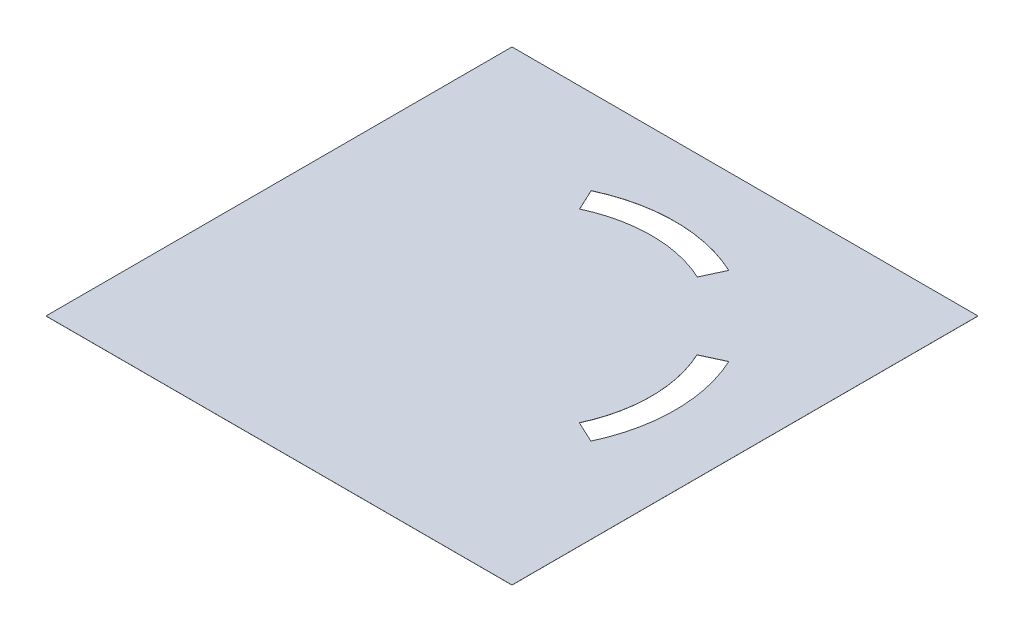
ISO-10303-21;
HEADER;
FILE_DESCRIPTION(('STEP AP214'),'2;1');
FILE_NAME('part.step','',(''),(''),'','','');
FILE_SCHEMA(('AUTOMOTIVE_DESIGN { 1 0 10303 214 1 1 1 1 }'));
ENDSEC;
DATA;
#1=APPLICATION_CONTEXT('core data for automotive mechanical design processes');
#2=APPLICATION_PROTOCOL_DEFINITION('international standard','automotive_design',2000,#1);
#3=PRODUCT_CONTEXT('',#1,'mechanical');
#4=PRODUCT('Part','Part','',(#3));
#5=PRODUCT_RELATED_PRODUCT_CATEGORY('part','',(#4));
#6=PRODUCT_DEFINITION_FORMATION('','',#4);
#7=PRODUCT_DEFINITION_CONTEXT('part definition',#1,'design');
#8=PRODUCT_DEFINITION('design','',#6,#7);
#9=PRODUCT_DEFINITION_SHAPE('','',#8);
#10=(LENGTH_UNIT() NAMED_UNIT(*) SI_UNIT(.MILLI.,.METRE.));
#11=(NAMED_UNIT(*) PLANE_ANGLE_UNIT() SI_UNIT($,.RADIAN.));
#12=(NAMED_UNIT(*) SI_UNIT($,.STERADIAN.) SOLID_ANGLE_UNIT());
#13=UNCERTAINTY_MEASURE_WITH_UNIT(LENGTH_MEASURE(1.E-05),#10,'distance_accuracy_value','');
#14=(GEOMETRIC_REPRESENTATION_CONTEXT(3) GLOBAL_UNCERTAINTY_ASSIGNED_CONTEXT((#13)) GLOBAL_UNIT_ASSIGNED_CONTEXT((#10,
#11,#12)) REPRESENTATION_CONTEXT('',''));
#15=CARTESIAN_POINT('',(0.,0.,0.));
#16=DIRECTION('',(0.,0.,1.));
#17=DIRECTION('',(1.,0.,0.));
#18=AXIS2_PLACEMENT_3D('',#15,#16,#17);
#19=CARTESIAN_POINT('',(13.2576267191403,0.0175,-13.2574791714362));
#20=DIRECTION('',(0.,-1.,0.));
#21=DIRECTION('',(0.,0.,-1.));
#22=AXIS2_PLACEMENT_3D('',#19,#20,#21);
#23=PLANE('',#22);
#24=CARTESIAN_POINT('',(53.4194512426701,0.0175,-53.4314063103269));
#25=DIRECTION('',(0.,-1.,0.));
#26=DIRECTION('',(0.,0.,-1.));
#27=AXIS2_PLACEMENT_3D('',#24,#25,#26);
#28=CIRCLE('',#27,24.0076771388907);
#29=CARTESIAN_POINT('',(43.2733684618004,0.0175,-75.1897510499654));
#30=VERTEX_POINT('',#29);
#31=CARTESIAN_POINT('',(63.56553402354,0.0175,-75.1897510499654));
#32=VERTEX_POINT('',#31);
#33=EDGE_CURVE('E160',#30,#32,#28,.T.);
#34=ORIENTED_EDGE('',*,*,#33,.F.);
#35=DIRECTION('',(0.422618261740692,0.,0.906307787036653));
#36=VECTOR('',#35,1.);
#37=CARTESIAN_POINT('',(43.2733684618004,0.0175,-75.1897510499654));
#38=LINE('',#37,#36);
#39=CARTESIAN_POINT('',(41.5290773816095,0.0175,-78.930395342818));
#40=VERTEX_POINT('',#39);
#41=EDGE_CURVE('E168',#40,#30,#38,.T.);
#42=ORIENTED_EDGE('',*,*,#41,.F.);
#43=CARTESIAN_POINT('',(53.3607026830961,0.0175,-53.6709418962078));
#44=DIRECTION('',(0.,1.,0.));
#45=DIRECTION('',(0.,0.,-1.));
#46=AXIS2_PLACEMENT_3D('',#43,#44,#45);
#47=CIRCLE('',#46,27.8931415530099);
#48=CARTESIAN_POINT('',(65.2886760566713,0.0175,-78.8850410650364));
#49=VERTEX_POINT('',#48);
#50=EDGE_CURVE('E165',#49,#40,#47,.T.);
#51=ORIENTED_EDGE('',*,*,#50,.F.);
#52=DIRECTION('',(0.422618261740697,0.,-0.906307787036651));
#53=VECTOR('',#52,1.);
#54=CARTESIAN_POINT('',(63.56553402354,0.0175,-75.1897510499654));
#55=LINE('',#54,#53);
#56=EDGE_CURVE('E162',#32,#49,#55,.T.);
#57=ORIENTED_EDGE('',*,*,#56,.F.);
#58=EDGE_LOOP('',(#34,#42,#51,#57));
#59=FACE_BOUND('',#58,.T.);
#60=DIRECTION('',(1.,0.,0.));
#61=VECTOR('',#60,1.);
#62=CARTESIAN_POINT('',(13.2576267191403,0.0175,-13.2574791714362));
#63=LINE('',#62,#61);
#64=CARTESIAN_POINT('',(13.2576267191403,0.0175,-13.2574791714362));
#65=VERTEX_POINT('',#64);
#66=CARTESIAN_POINT('',(93.5601267191403,0.0175,-13.2574791714362));
#67=VERTEX_POINT('',#66);
#68=EDGE_CURVE('E191',#65,#67,#63,.T.);
#69=ORIENTED_EDGE('',*,*,#68,.T.);
#70=DIRECTION('',(0.,0.,-1.));
#71=VECTOR('',#70,1.);
#72=CARTESIAN_POINT('',(93.5601267191403,0.0175,-93.5599791714362));
#73=LINE('',#72,#71);
#74=CARTESIAN_POINT('',(93.5601267191403,0.0175,-93.5599791714362));
#75=VERTEX_POINT('',#74);
#76=EDGE_CURVE('E194',#67,#75,#73,.T.);
#77=ORIENTED_EDGE('',*,*,#76,.T.);
#78=DIRECTION('',(-1.,0.,0.));
#79=VECTOR('',#78,1.);
#80=CARTESIAN_POINT('',(13.2576267191403,0.0175,-93.5599791714362));
#81=LINE('',#80,#79);
#82=CARTESIAN_POINT('',(13.2576267191403,0.0175,-93.5599791714362));
#83=VERTEX_POINT('',#82);
#84=EDGE_CURVE('E197',#75,#83,#81,.T.);
#85=ORIENTED_EDGE('',*,*,#84,.T.);
#86=DIRECTION('',(0.,0.,1.));
#87=VECTOR('',#86,1.);
#88=CARTESIAN_POINT('',(13.2576267191403,0.0175,-13.2574791714362));
#89=LINE('',#88,#87);
#90=EDGE_CURVE('E199',#83,#65,#89,.T.);
#91=ORIENTED_EDGE('',*,*,#90,.T.);
#92=EDGE_LOOP('',(#69,#77,#85,#91));
#93=FACE_BOUND('',#92,.T.);
#94=CARTESIAN_POINT('',(53.4088767191403,0.0175,-53.4087291714362));
#95=DIRECTION('',(0.,-1.,0.));
#96=DIRECTION('',(0.,0.,-1.));
#97=AXIS2_PLACEMENT_3D('',#94,#95,#96);
#98=CIRCLE('',#97,23.9850000000001);
#99=CARTESIAN_POINT('',(75.1466689912143,0.0175,-63.5452281792869));
#100=VERTEX_POINT('',#99);
#101=CARTESIAN_POINT('',(75.1466689912144,0.0175,-43.2722301635855));
#102=VERTEX_POINT('',#101);
#103=EDGE_CURVE('E124',#100,#102,#98,.T.);
#104=ORIENTED_EDGE('',*,*,#103,.F.);
#105=DIRECTION('',(-0.906307787036649,0.,0.422618261740701));
#106=VECTOR('',#105,1.);
#107=CARTESIAN_POINT('',(75.1466689912143,0.0175,-63.5452281792869));
#108=LINE('',#107,#106);
#109=CARTESIAN_POINT('',(78.8851886127405,0.0175,-65.2885285089673));
#110=VERTEX_POINT('',#109);
#111=EDGE_CURVE('E146',#110,#100,#108,.T.);
#112=ORIENTED_EDGE('',*,*,#111,.F.);
#113=CARTESIAN_POINT('',(53.4088767191403,0.0175,-53.4087291714361));
#114=DIRECTION('',(0.,1.,0.));
#115=DIRECTION('',(0.,0.,-1.));
#116=AXIS2_PLACEMENT_3D('',#113,#114,#115);
#117=CIRCLE('',#116,28.11);
#118=CARTESIAN_POINT('',(78.8851886127405,0.0175,-41.5289298339051));
#119=VERTEX_POINT('',#118);
#120=EDGE_CURVE('E144',#119,#110,#117,.T.);
#121=ORIENTED_EDGE('',*,*,#120,.F.);
#122=DIRECTION('',(0.906307787036649,0.,0.422618261740701));
#123=VECTOR('',#122,1.);
#124=CARTESIAN_POINT('',(75.1466689912144,0.0175,-43.2722301635855));
#125=LINE('',#124,#123);
#126=EDGE_CURVE('E132',#102,#119,#125,.T.);
#127=ORIENTED_EDGE('',*,*,#126,.F.);
#128=EDGE_LOOP('',(#104,#112,#121,#127));
#129=FACE_BOUND('',#128,.T.);
#130=ADVANCED_FACE('F35',(#59,#93,#129),#23,.F.);
#131=CARTESIAN_POINT('',(13.2576267191403,0.0025,-13.2574791714362));
#132=DIRECTION('',(0.,-1.,0.));
#133=DIRECTION('',(0.,0.,-1.));
#134=AXIS2_PLACEMENT_3D('',#131,#132,#133);
#135=PLANE('',#134);
#136=DIRECTION('',(1.,0.,0.));
#137=VECTOR('',#136,1.);
#138=CARTESIAN_POINT('',(13.2576267191403,0.0025,-13.2574791714362));
#139=LINE('',#138,#137);
#140=CARTESIAN_POINT('',(13.2576267191403,0.0025,-13.2574791714362));
#141=VERTEX_POINT('',#140);
#142=CARTESIAN_POINT('',(93.5601267191403,0.0025,-13.2574791714362));
#143=VERTEX_POINT('',#142);
#144=EDGE_CURVE('E190',#141,#143,#139,.T.);
#145=ORIENTED_EDGE('',*,*,#144,.F.);
#146=DIRECTION('',(0.,0.,1.));
#147=VECTOR('',#146,1.);
#148=CARTESIAN_POINT('',(13.2576267191403,0.0025,-13.2574791714362));
#149=LINE('',#148,#147);
#150=CARTESIAN_POINT('',(13.2576267191403,0.0025,-93.5599791714362));
#151=VERTEX_POINT('',#150);
#152=EDGE_CURVE('E195',#151,#141,#149,.T.);
#153=ORIENTED_EDGE('',*,*,#152,.F.);
#154=DIRECTION('',(-1.,0.,0.));
#155=VECTOR('',#154,1.);
#156=CARTESIAN_POINT('',(13.2576267191403,0.0025,-93.5599791714362));
#157=LINE('',#156,#155);
#158=CARTESIAN_POINT('',(93.5601267191403,0.0025,-93.5599791714362));
#159=VERTEX_POINT('',#158);
#160=EDGE_CURVE('E206',#159,#151,#157,.T.);
#161=ORIENTED_EDGE('',*,*,#160,.F.);
#162=DIRECTION('',(0.,0.,-1.));
#163=VECTOR('',#162,1.);
#164=CARTESIAN_POINT('',(93.5601267191403,0.0025,-93.5599791714362));
#165=LINE('',#164,#163);
#166=EDGE_CURVE('E204',#143,#159,#165,.T.);
#167=ORIENTED_EDGE('',*,*,#166,.F.);
#168=EDGE_LOOP('',(#145,#153,#161,#167));
#169=FACE_BOUND('',#168,.T.);
#170=DIRECTION('',(0.422618261740692,0.,0.906307787036653));
#171=VECTOR('',#170,1.);
#172=CARTESIAN_POINT('',(43.2733684618004,0.0025,-75.1897510499654));
#173=LINE('',#172,#171);
#174=CARTESIAN_POINT('',(41.5290773816095,0.0025,-78.930395342818));
#175=VERTEX_POINT('',#174);
#176=CARTESIAN_POINT('',(43.2733684618004,0.0025,-75.1897510499655));
#177=VERTEX_POINT('',#176);
#178=EDGE_CURVE('E163',#175,#177,#173,.T.);
#179=ORIENTED_EDGE('',*,*,#178,.T.);
#180=CARTESIAN_POINT('',(53.4194512426701,0.0025,-53.4314063103269));
#181=DIRECTION('',(0.,-1.,0.));
#182=DIRECTION('',(0.,0.,-1.));
#183=AXIS2_PLACEMENT_3D('',#180,#181,#182);
#184=CIRCLE('',#183,24.0076771388907);
#185=CARTESIAN_POINT('',(63.56553402354,0.0025,-75.1897510499654));
#186=VERTEX_POINT('',#185);
#187=EDGE_CURVE('E140',#177,#186,#184,.T.);
#188=ORIENTED_EDGE('',*,*,#187,.T.);
#189=DIRECTION('',(0.422618261740697,0.,-0.906307787036651));
#190=VECTOR('',#189,1.);
#191=CARTESIAN_POINT('',(63.56553402354,0.0025,-75.1897510499654));
#192=LINE('',#191,#190);
#193=CARTESIAN_POINT('',(65.2886760566713,0.0025,-78.8850410650364));
#194=VERTEX_POINT('',#193);
#195=EDGE_CURVE('E173',#186,#194,#192,.T.);
#196=ORIENTED_EDGE('',*,*,#195,.T.);
#197=CARTESIAN_POINT('',(53.3607026830961,0.0025,-53.6709418962078));
#198=DIRECTION('',(0.,1.,0.));
#199=DIRECTION('',(0.,0.,-1.));
#200=AXIS2_PLACEMENT_3D('',#197,#198,#199);
#201=CIRCLE('',#200,27.8931415530099);
#202=EDGE_CURVE('E176',#194,#175,#201,.T.);
#203=ORIENTED_EDGE('',*,*,#202,.T.);
#204=EDGE_LOOP('',(#179,#188,#196,#203));
#205=FACE_BOUND('',#204,.T.);
#206=DIRECTION('',(-0.906307787036649,0.,0.422618261740701));
#207=VECTOR('',#206,1.);
#208=CARTESIAN_POINT('',(75.1466689912143,0.0025,-63.5452281792869));
#209=LINE('',#208,#207);
#210=CARTESIAN_POINT('',(78.8851886127405,0.0025,-65.2885285089673));
#211=VERTEX_POINT('',#210);
#212=CARTESIAN_POINT('',(75.1466689912143,0.0025,-63.5452281792869));
#213=VERTEX_POINT('',#212);
#214=EDGE_CURVE('E133',#211,#213,#209,.T.);
#215=ORIENTED_EDGE('',*,*,#214,.T.);
#216=CARTESIAN_POINT('',(53.4088767191403,0.0025,-53.4087291714362));
#217=DIRECTION('',(0.,-1.,0.));
#218=DIRECTION('',(0.,0.,-1.));
#219=AXIS2_PLACEMENT_3D('',#216,#217,#218);
#220=CIRCLE('',#219,23.9850000000001);
#221=CARTESIAN_POINT('',(75.1466689912144,0.0025,-43.2722301635855));
#222=VERTEX_POINT('',#221);
#223=EDGE_CURVE('E58',#213,#222,#220,.T.);
#224=ORIENTED_EDGE('',*,*,#223,.T.);
#225=DIRECTION('',(0.906307787036649,0.,0.422618261740701));
#226=VECTOR('',#225,1.);
#227=CARTESIAN_POINT('',(75.1466689912144,0.0025,-43.2722301635855));
#228=LINE('',#227,#226);
#229=CARTESIAN_POINT('',(78.8851886127405,0.0025,-41.5289298339051));
#230=VERTEX_POINT('',#229);
#231=EDGE_CURVE('E139',#222,#230,#228,.T.);
#232=ORIENTED_EDGE('',*,*,#231,.T.);
#233=CARTESIAN_POINT('',(53.4088767191403,0.0025,-53.4087291714361));
#234=DIRECTION('',(0.,1.,0.));
#235=DIRECTION('',(0.,0.,-1.));
#236=AXIS2_PLACEMENT_3D('',#233,#234,#235);
#237=CIRCLE('',#236,28.11);
#238=EDGE_CURVE('E152',#230,#211,#237,.T.);
#239=ORIENTED_EDGE('',*,*,#238,.T.);
#240=EDGE_LOOP('',(#215,#224,#232,#239));
#241=FACE_BOUND('',#240,.T.);
#242=ADVANCED_FACE('F224',(#169,#205,#241),#135,.T.);
#243=CARTESIAN_POINT('',(13.2576267191403,0.0175,-13.2574791714362));
#244=DIRECTION('',(0.,0.,-1.));
#245=DIRECTION('',(-1.,0.,0.));
#246=AXIS2_PLACEMENT_3D('',#243,#244,#245);
#247=PLANE('',#246);
#248=ORIENTED_EDGE('',*,*,#144,.T.);
#249=DIRECTION('',(0.,-1.,0.));
#250=VECTOR('',#249,1.);
#251=CARTESIAN_POINT('',(93.5601267191403,0.0175,-13.2574791714362));
#252=LINE('',#251,#250);
#253=EDGE_CURVE('E11',#67,#143,#252,.T.);
#254=ORIENTED_EDGE('',*,*,#253,.F.);
#255=ORIENTED_EDGE('',*,*,#68,.F.);
#256=DIRECTION('',(0.,-1.,0.));
#257=VECTOR('',#256,1.);
#258=CARTESIAN_POINT('',(13.2576267191403,0.0175,-13.2574791714362));
#259=LINE('',#258,#257);
#260=EDGE_CURVE('E201',#65,#141,#259,.T.);
#261=ORIENTED_EDGE('',*,*,#260,.T.);
#262=EDGE_LOOP('',(#248,#254,#255,#261));
#263=FACE_BOUND('',#262,.T.);
#264=ADVANCED_FACE('F37',(#263),#247,.F.);
#265=CARTESIAN_POINT('',(93.5601267191403,0.0175,-93.5599791714362));
#266=DIRECTION('',(-1.,0.,0.));
#267=DIRECTION('',(0.,0.,1.));
#268=AXIS2_PLACEMENT_3D('',#265,#266,#267);
#269=PLANE('',#268);
#270=ORIENTED_EDGE('',*,*,#166,.T.);
#271=DIRECTION('',(0.,-1.,0.));
#272=VECTOR('',#271,1.);
#273=CARTESIAN_POINT('',(93.5601267191403,0.0175,-93.5599791714362));
#274=LINE('',#273,#272);
#275=EDGE_CURVE('E43',#75,#159,#274,.T.);
#276=ORIENTED_EDGE('',*,*,#275,.F.);
#277=ORIENTED_EDGE('',*,*,#76,.F.);
#278=ORIENTED_EDGE('',*,*,#253,.T.);
#279=EDGE_LOOP('',(#270,#276,#277,#278));
#280=FACE_BOUND('',#279,.T.);
#281=ADVANCED_FACE('F234',(#280),#269,.F.);
#282=CARTESIAN_POINT('',(13.2576267191403,0.0175,-93.5599791714362));
#283=DIRECTION('',(0.,0.,1.));
#284=DIRECTION('',(1.,0.,0.));
#285=AXIS2_PLACEMENT_3D('',#282,#283,#284);
#286=PLANE('',#285);
#287=ORIENTED_EDGE('',*,*,#160,.T.);
#288=DIRECTION('',(0.,-1.,0.));
#289=VECTOR('',#288,1.);
#290=CARTESIAN_POINT('',(13.2576267191403,0.0175,-93.5599791714362));
#291=LINE('',#290,#289);
#292=EDGE_CURVE('E211',#83,#151,#291,.T.);
#293=ORIENTED_EDGE('',*,*,#292,.F.);
#294=ORIENTED_EDGE('',*,*,#84,.F.);
#295=ORIENTED_EDGE('',*,*,#275,.T.);
#296=EDGE_LOOP('',(#287,#293,#294,#295));
#297=FACE_BOUND('',#296,.T.);
#298=ADVANCED_FACE('F218',(#297),#286,.F.);
#299=CARTESIAN_POINT('',(13.2576267191403,0.0175,-13.2574791714362));
#300=DIRECTION('',(1.,0.,0.));
#301=DIRECTION('',(0.,0.,-1.));
#302=AXIS2_PLACEMENT_3D('',#299,#300,#301);
#303=PLANE('',#302);
#304=ORIENTED_EDGE('',*,*,#152,.T.);
#305=ORIENTED_EDGE('',*,*,#260,.F.);
#306=ORIENTED_EDGE('',*,*,#90,.F.);
#307=ORIENTED_EDGE('',*,*,#292,.T.);
#308=EDGE_LOOP('',(#304,#305,#306,#307));
#309=FACE_BOUND('',#308,.T.);
#310=ADVANCED_FACE('F228',(#309),#303,.F.);
#311=CARTESIAN_POINT('',(53.4194512426701,0.0175,-53.4314063103269));
#312=DIRECTION('',(0.,-1.,0.));
#313=DIRECTION('',(0.,0.,-1.));
#314=AXIS2_PLACEMENT_3D('',#311,#312,#313);
#315=CYLINDRICAL_SURFACE('',#314,24.0076771388907);
#316=ORIENTED_EDGE('',*,*,#187,.F.);
#317=DIRECTION('',(0.,-1.,0.));
#318=VECTOR('',#317,1.);
#319=CARTESIAN_POINT('',(43.2733684618004,0.0175,-75.1897510499654));
#320=LINE('',#319,#318);
#321=EDGE_CURVE('E170',#30,#177,#320,.T.);
#322=ORIENTED_EDGE('',*,*,#321,.F.);
#323=ORIENTED_EDGE('',*,*,#33,.T.);
#324=DIRECTION('',(0.,-1.,0.));
#325=VECTOR('',#324,1.);
#326=CARTESIAN_POINT('',(63.56553402354,0.0175,-75.1897510499654));
#327=LINE('',#326,#325);
#328=EDGE_CURVE('E187',#32,#186,#327,.T.);
#329=ORIENTED_EDGE('',*,*,#328,.T.);
#330=EDGE_LOOP('',(#316,#322,#323,#329));
#331=FACE_BOUND('',#330,.T.);
#332=ADVANCED_FACE('F250',(#331),#315,.T.);
#333=CARTESIAN_POINT('',(63.56553402354,0.0175,-75.1897510499654));
#334=DIRECTION('',(-0.906307787036651,0.,-0.422618261740697));
#335=DIRECTION('',(-0.422618261740697,0.,0.906307787036651));
#336=AXIS2_PLACEMENT_3D('',#333,#334,#335);
#337=PLANE('',#336);
#338=ORIENTED_EDGE('',*,*,#195,.F.);
#339=ORIENTED_EDGE('',*,*,#328,.F.);
#340=ORIENTED_EDGE('',*,*,#56,.T.);
#341=DIRECTION('',(0.,-1.,0.));
#342=VECTOR('',#341,1.);
#343=CARTESIAN_POINT('',(65.2886760566713,0.0175,-78.8850410650364));
#344=LINE('',#343,#342);
#345=EDGE_CURVE('E185',#49,#194,#344,.T.);
#346=ORIENTED_EDGE('',*,*,#345,.T.);
#347=EDGE_LOOP('',(#338,#339,#340,#346));
#348=FACE_BOUND('',#347,.T.);
#349=ADVANCED_FACE('F257',(#348),#337,.T.);
#350=CARTESIAN_POINT('',(53.3607026830961,0.0175,-53.6709418962078));
#351=DIRECTION('',(0.,-1.,0.));
#352=DIRECTION('',(0.,0.,-1.));
#353=AXIS2_PLACEMENT_3D('',#350,#351,#352);
#354=CYLINDRICAL_SURFACE('',#353,27.8931415530099);
#355=ORIENTED_EDGE('',*,*,#202,.F.);
#356=ORIENTED_EDGE('',*,*,#345,.F.);
#357=ORIENTED_EDGE('',*,*,#50,.T.);
#358=DIRECTION('',(0.,-1.,0.));
#359=VECTOR('',#358,1.);
#360=CARTESIAN_POINT('',(41.5290773816095,0.0175,-78.930395342818));
#361=LINE('',#360,#359);
#362=EDGE_CURVE('E183',#40,#175,#361,.T.);
#363=ORIENTED_EDGE('',*,*,#362,.T.);
#364=EDGE_LOOP('',(#355,#356,#357,#363));
#365=FACE_BOUND('',#364,.T.);
#366=ADVANCED_FACE('F262',(#365),#354,.F.);
#367=CARTESIAN_POINT('',(43.2733684618004,0.0175,-75.1897510499654));
#368=DIRECTION('',(0.906307787036653,0.,-0.422618261740692));
#369=DIRECTION('',(-0.422618261740692,0.,-0.906307787036653));
#370=AXIS2_PLACEMENT_3D('',#367,#368,#369);
#371=PLANE('',#370);
#372=ORIENTED_EDGE('',*,*,#178,.F.);
#373=ORIENTED_EDGE('',*,*,#362,.F.);
#374=ORIENTED_EDGE('',*,*,#41,.T.);
#375=ORIENTED_EDGE('',*,*,#321,.T.);
#376=EDGE_LOOP('',(#372,#373,#374,#375));
#377=FACE_BOUND('',#376,.T.);
#378=ADVANCED_FACE('F268',(#377),#371,.T.);
#379=CARTESIAN_POINT('',(53.4088767191403,0.0175,-53.4087291714362));
#380=DIRECTION('',(0.,-1.,0.));
#381=DIRECTION('',(0.,0.,-1.));
#382=AXIS2_PLACEMENT_3D('',#379,#380,#381);
#383=CYLINDRICAL_SURFACE('',#382,23.9850000000001);
#384=ORIENTED_EDGE('',*,*,#223,.F.);
#385=DIRECTION('',(0.,-1.,0.));
#386=VECTOR('',#385,1.);
#387=CARTESIAN_POINT('',(75.1466689912143,0.0175,-63.5452281792869));
#388=LINE('',#387,#386);
#389=EDGE_CURVE('E128',#100,#213,#388,.T.);
#390=ORIENTED_EDGE('',*,*,#389,.F.);
#391=ORIENTED_EDGE('',*,*,#103,.T.);
#392=DIRECTION('',(0.,-1.,0.));
#393=VECTOR('',#392,1.);
#394=CARTESIAN_POINT('',(75.1466689912144,0.0175,-43.2722301635855));
#395=LINE('',#394,#393);
#396=EDGE_CURVE('E127',#102,#222,#395,.T.);
#397=ORIENTED_EDGE('',*,*,#396,.T.);
#398=EDGE_LOOP('',(#384,#390,#391,#397));
#399=FACE_BOUND('',#398,.T.);
#400=ADVANCED_FACE('F126',(#399),#383,.T.);
#401=CARTESIAN_POINT('',(75.1466689912144,0.0175,-43.2722301635855));
#402=DIRECTION('',(0.422618261740701,0.,-0.906307787036649));
#403=DIRECTION('',(-0.906307787036649,0.,-0.422618261740701));
#404=AXIS2_PLACEMENT_3D('',#401,#402,#403);
#405=PLANE('',#404);
#406=ORIENTED_EDGE('',*,*,#231,.F.);
#407=ORIENTED_EDGE('',*,*,#396,.F.);
#408=ORIENTED_EDGE('',*,*,#126,.T.);
#409=DIRECTION('',(0.,-1.,0.));
#410=VECTOR('',#409,1.);
#411=CARTESIAN_POINT('',(78.8851886127405,0.0175,-41.5289298339051));
#412=LINE('',#411,#410);
#413=EDGE_CURVE('E141',#119,#230,#412,.T.);
#414=ORIENTED_EDGE('',*,*,#413,.T.);
#415=EDGE_LOOP('',(#406,#407,#408,#414));
#416=FACE_BOUND('',#415,.T.);
#417=ADVANCED_FACE('F136',(#416),#405,.T.);
#418=CARTESIAN_POINT('',(53.4088767191403,0.0175,-53.4087291714361));
#419=DIRECTION('',(0.,-1.,0.));
#420=DIRECTION('',(0.,0.,-1.));
#421=AXIS2_PLACEMENT_3D('',#418,#419,#420);
#422=CYLINDRICAL_SURFACE('',#421,28.11);
#423=ORIENTED_EDGE('',*,*,#238,.F.);
#424=ORIENTED_EDGE('',*,*,#413,.F.);
#425=ORIENTED_EDGE('',*,*,#120,.T.);
#426=DIRECTION('',(0.,-1.,0.));
#427=VECTOR('',#426,1.);
#428=CARTESIAN_POINT('',(78.8851886127405,0.0175,-65.2885285089673));
#429=LINE('',#428,#427);
#430=EDGE_CURVE('E50',#110,#211,#429,.T.);
#431=ORIENTED_EDGE('',*,*,#430,.T.);
#432=EDGE_LOOP('',(#423,#424,#425,#431));
#433=FACE_BOUND('',#432,.T.);
#434=ADVANCED_FACE('F287',(#433),#422,.F.);
#435=CARTESIAN_POINT('',(75.1466689912143,0.0175,-63.5452281792869));
#436=DIRECTION('',(0.422618261740701,0.,0.906307787036649));
#437=DIRECTION('',(0.906307787036649,0.,-0.422618261740701));
#438=AXIS2_PLACEMENT_3D('',#435,#436,#437);
#439=PLANE('',#438);
#440=ORIENTED_EDGE('',*,*,#214,.F.);
#441=ORIENTED_EDGE('',*,*,#430,.F.);
#442=ORIENTED_EDGE('',*,*,#111,.T.);
#443=ORIENTED_EDGE('',*,*,#389,.T.);
#444=EDGE_LOOP('',(#440,#441,#442,#443));
#445=FACE_BOUND('',#444,.T.);
#446=ADVANCED_FACE('F290',(#445),#439,.T.);
#447=CLOSED_SHELL('',(#130,#242,#264,#281,#298,#310,#332,#349,#366,#378,#400,#417,#434,#446));
#448=MANIFOLD_SOLID_BREP('B2',#447);
#449=ADVANCED_BREP_SHAPE_REPRESENTATION('',(#18,#448),#14);
#450=SHAPE_DEFINITION_REPRESENTATION(#9,#449);
ENDSEC;
END-ISO-10303-21;
